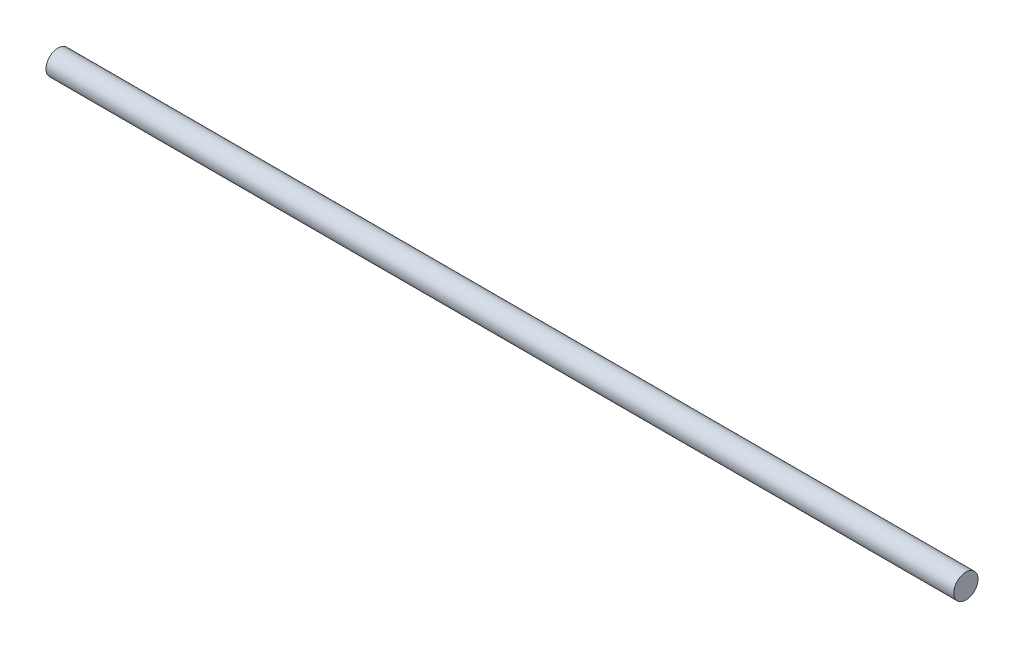
ISO-10303-21;
HEADER;
FILE_DESCRIPTION(('STEP AP214'),'2;1');
FILE_NAME('part.step','',(''),(''),'','','');
FILE_SCHEMA(('AUTOMOTIVE_DESIGN { 1 0 10303 214 1 1 1 1 }'));
ENDSEC;
DATA;
#1=APPLICATION_CONTEXT('core data for automotive mechanical design processes');
#2=APPLICATION_PROTOCOL_DEFINITION('international standard','automotive_design',2000,#1);
#3=PRODUCT_CONTEXT('',#1,'mechanical');
#4=PRODUCT('Part','Part','',(#3));
#5=PRODUCT_RELATED_PRODUCT_CATEGORY('part','',(#4));
#6=PRODUCT_DEFINITION_FORMATION('','',#4);
#7=PRODUCT_DEFINITION_CONTEXT('part definition',#1,'design');
#8=PRODUCT_DEFINITION('design','',#6,#7);
#9=PRODUCT_DEFINITION_SHAPE('','',#8);
#10=(LENGTH_UNIT() NAMED_UNIT(*) SI_UNIT(.MILLI.,.METRE.));
#11=(NAMED_UNIT(*) PLANE_ANGLE_UNIT() SI_UNIT($,.RADIAN.));
#12=(NAMED_UNIT(*) SI_UNIT($,.STERADIAN.) SOLID_ANGLE_UNIT());
#13=UNCERTAINTY_MEASURE_WITH_UNIT(LENGTH_MEASURE(1.E-05),#10,'distance_accuracy_value','');
#14=(GEOMETRIC_REPRESENTATION_CONTEXT(3) GLOBAL_UNCERTAINTY_ASSIGNED_CONTEXT((#13)) GLOBAL_UNIT_ASSIGNED_CONTEXT((#10,
#11,#12)) REPRESENTATION_CONTEXT('',''));
#15=CARTESIAN_POINT('',(0.,0.,0.));
#16=DIRECTION('',(0.,0.,1.));
#17=DIRECTION('',(1.,0.,0.));
#18=AXIS2_PLACEMENT_3D('',#15,#16,#17);
#19=CARTESIAN_POINT('',(150.,0.,0.));
#20=DIRECTION('',(-1.,0.,0.));
#21=DIRECTION('',(0.,0.,1.));
#22=AXIS2_PLACEMENT_3D('',#19,#20,#21);
#23=CYLINDRICAL_SURFACE('',#22,2.);
#24=CARTESIAN_POINT('',(150.,0.,0.));
#25=DIRECTION('',(1.,0.,0.));
#26=DIRECTION('',(0.,0.,-1.));
#27=AXIS2_PLACEMENT_3D('',#24,#25,#26);
#28=CIRCLE('',#27,2.);
#29=CARTESIAN_POINT('',(150.,0.,-2.));
#30=VERTEX_POINT('',#29);
#31=EDGE_CURVE('E10',#30,#30,#28,.T.);
#32=ORIENTED_EDGE('',*,*,#31,.F.);
#33=EDGE_LOOP('',(#32));
#34=FACE_BOUND('',#33,.T.);
#35=CARTESIAN_POINT('',(0.,0.,0.));
#36=DIRECTION('',(1.,0.,0.));
#37=DIRECTION('',(0.,0.,-1.));
#38=AXIS2_PLACEMENT_3D('',#35,#36,#37);
#39=CIRCLE('',#38,2.);
#40=CARTESIAN_POINT('',(0.,0.,-2.));
#41=VERTEX_POINT('',#40);
#42=EDGE_CURVE('E36',#41,#41,#39,.T.);
#43=ORIENTED_EDGE('',*,*,#42,.T.);
#44=EDGE_LOOP('',(#43));
#45=FACE_BOUND('',#44,.T.);
#46=ADVANCED_FACE('F33',(#34,#45),#23,.T.);
#47=CARTESIAN_POINT('',(150.,0.,0.));
#48=DIRECTION('',(1.,0.,0.));
#49=DIRECTION('',(0.,0.,-1.));
#50=AXIS2_PLACEMENT_3D('',#47,#48,#49);
#51=PLANE('',#50);
#52=ORIENTED_EDGE('',*,*,#31,.T.);
#53=EDGE_LOOP('',(#52));
#54=FACE_BOUND('',#53,.T.);
#55=ADVANCED_FACE('F48',(#54),#51,.T.);
#56=CARTESIAN_POINT('',(0.,0.,0.));
#57=DIRECTION('',(1.,0.,0.));
#58=DIRECTION('',(0.,0.,-1.));
#59=AXIS2_PLACEMENT_3D('',#56,#57,#58);
#60=PLANE('',#59);
#61=ORIENTED_EDGE('',*,*,#42,.F.);
#62=EDGE_LOOP('',(#61));
#63=FACE_BOUND('',#62,.T.);
#64=ADVANCED_FACE('F46',(#63),#60,.F.);
#65=CLOSED_SHELL('',(#46,#55,#64));
#66=MANIFOLD_SOLID_BREP('B2',#65);
#67=ADVANCED_BREP_SHAPE_REPRESENTATION('',(#18,#66),#14);
#68=SHAPE_DEFINITION_REPRESENTATION(#9,#67);
ENDSEC;
END-ISO-10303-21;
